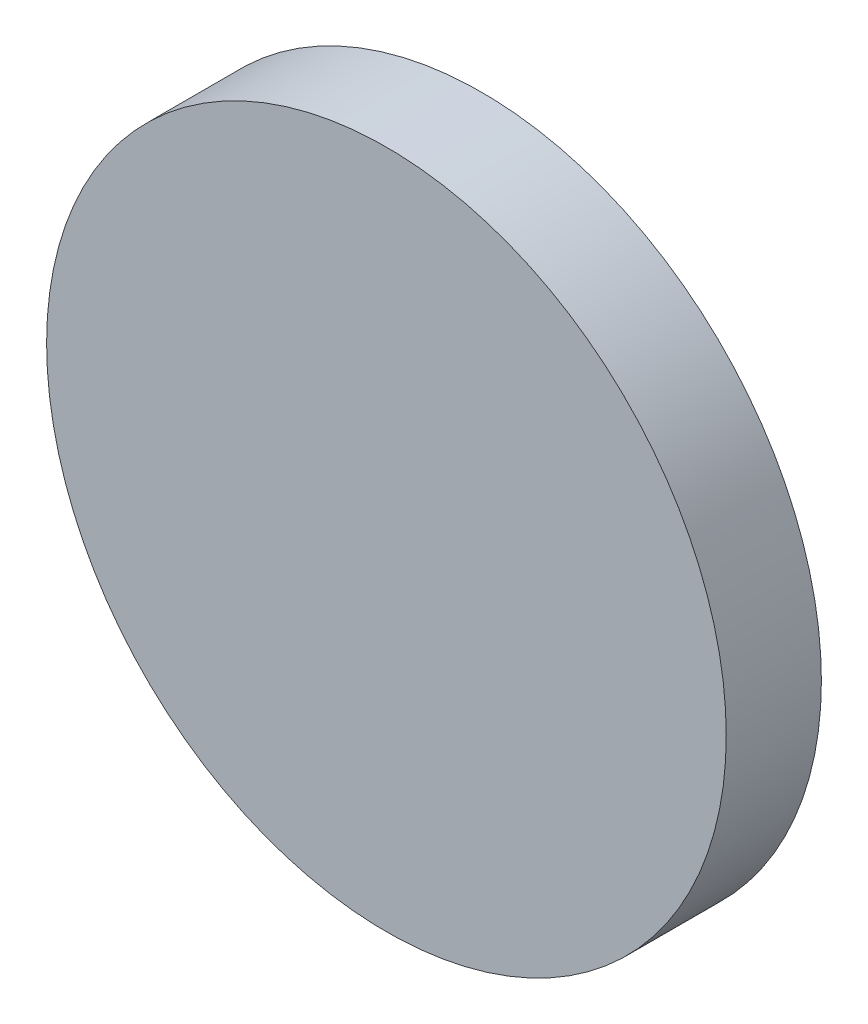
ISO-10303-21;
HEADER;
FILE_DESCRIPTION(('STEP AP214'),'2;1');
FILE_NAME('part.step','',(''),(''),'','','');
FILE_SCHEMA(('AUTOMOTIVE_DESIGN { 1 0 10303 214 1 1 1 1 }'));
ENDSEC;
DATA;
#1=APPLICATION_CONTEXT('core data for automotive mechanical design processes');
#2=APPLICATION_PROTOCOL_DEFINITION('international standard','automotive_design',2000,#1);
#3=PRODUCT_CONTEXT('',#1,'mechanical');
#4=PRODUCT('Part','Part','',(#3));
#5=PRODUCT_RELATED_PRODUCT_CATEGORY('part','',(#4));
#6=PRODUCT_DEFINITION_FORMATION('','',#4);
#7=PRODUCT_DEFINITION_CONTEXT('part definition',#1,'design');
#8=PRODUCT_DEFINITION('design','',#6,#7);
#9=PRODUCT_DEFINITION_SHAPE('','',#8);
#10=(LENGTH_UNIT() NAMED_UNIT(*) SI_UNIT(.MILLI.,.METRE.));
#11=(NAMED_UNIT(*) PLANE_ANGLE_UNIT() SI_UNIT($,.RADIAN.));
#12=(NAMED_UNIT(*) SI_UNIT($,.STERADIAN.) SOLID_ANGLE_UNIT());
#13=UNCERTAINTY_MEASURE_WITH_UNIT(LENGTH_MEASURE(1.E-05),#10,'distance_accuracy_value','');
#14=(GEOMETRIC_REPRESENTATION_CONTEXT(3) GLOBAL_UNCERTAINTY_ASSIGNED_CONTEXT((#13)) GLOBAL_UNIT_ASSIGNED_CONTEXT((#10,
#11,#12)) REPRESENTATION_CONTEXT('',''));
#15=CARTESIAN_POINT('',(0.,0.,0.));
#16=DIRECTION('',(0.,0.,1.));
#17=DIRECTION('',(1.,0.,0.));
#18=AXIS2_PLACEMENT_3D('',#15,#16,#17);
#19=CARTESIAN_POINT('',(0.,0.,3.5));
#20=DIRECTION('',(0.,0.,-1.));
#21=DIRECTION('',(-1.,0.,0.));
#22=AXIS2_PLACEMENT_3D('',#19,#20,#21);
#23=CYLINDRICAL_SURFACE('',#22,12.5);
#24=CARTESIAN_POINT('',(0.,0.,3.5));
#25=DIRECTION('',(0.,0.,1.));
#26=DIRECTION('',(1.,0.,0.));
#27=AXIS2_PLACEMENT_3D('',#24,#25,#26);
#28=CIRCLE('',#27,12.5);
#29=CARTESIAN_POINT('',(12.5,0.,3.5));
#30=VERTEX_POINT('',#29);
#31=EDGE_CURVE('E10',#30,#30,#28,.T.);
#32=ORIENTED_EDGE('',*,*,#31,.F.);
#33=EDGE_LOOP('',(#32));
#34=FACE_BOUND('',#33,.T.);
#35=CARTESIAN_POINT('',(0.,0.,0.));
#36=DIRECTION('',(0.,0.,1.));
#37=DIRECTION('',(1.,0.,0.));
#38=AXIS2_PLACEMENT_3D('',#35,#36,#37);
#39=CIRCLE('',#38,12.5);
#40=CARTESIAN_POINT('',(12.5,0.,0.));
#41=VERTEX_POINT('',#40);
#42=EDGE_CURVE('E40',#41,#41,#39,.T.);
#43=ORIENTED_EDGE('',*,*,#42,.T.);
#44=EDGE_LOOP('',(#43));
#45=FACE_BOUND('',#44,.T.);
#46=ADVANCED_FACE('F37',(#34,#45),#23,.T.);
#47=CARTESIAN_POINT('',(0.,0.,3.5));
#48=DIRECTION('',(0.,0.,1.));
#49=DIRECTION('',(1.,0.,0.));
#50=AXIS2_PLACEMENT_3D('',#47,#48,#49);
#51=PLANE('',#50);
#52=ORIENTED_EDGE('',*,*,#31,.T.);
#53=EDGE_LOOP('',(#52));
#54=FACE_BOUND('',#53,.T.);
#55=ADVANCED_FACE('F54',(#54),#51,.T.);
#56=CARTESIAN_POINT('',(0.,0.,0.));
#57=DIRECTION('',(0.,0.,1.));
#58=DIRECTION('',(1.,0.,0.));
#59=AXIS2_PLACEMENT_3D('',#56,#57,#58);
#60=PLANE('',#59);
#61=ORIENTED_EDGE('',*,*,#42,.F.);
#62=EDGE_LOOP('',(#61));
#63=FACE_BOUND('',#62,.T.);
#64=ADVANCED_FACE('F52',(#63),#60,.F.);
#65=CLOSED_SHELL('',(#46,#55,#64));
#66=MANIFOLD_SOLID_BREP('B2',#65);
#67=ADVANCED_BREP_SHAPE_REPRESENTATION('',(#18,#66),#14);
#68=SHAPE_DEFINITION_REPRESENTATION(#9,#67);
ENDSEC;
END-ISO-10303-21;
